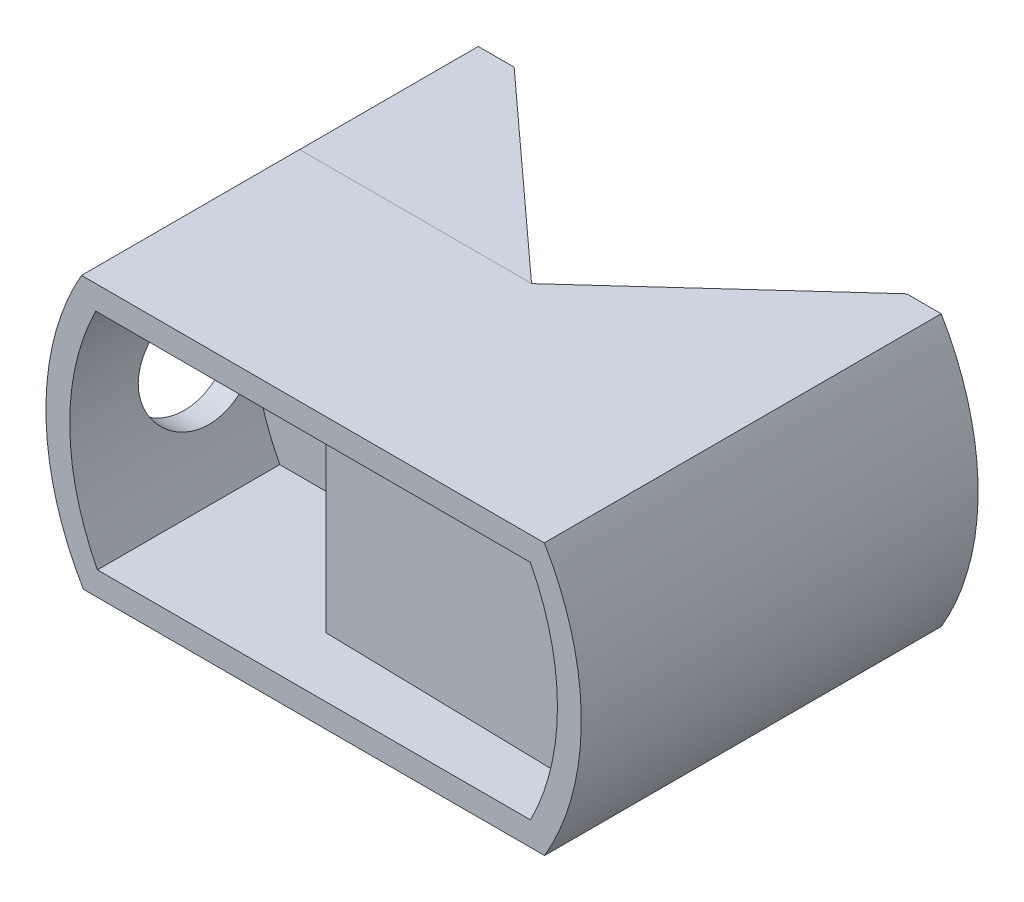
ISO-10303-21;
HEADER;
FILE_DESCRIPTION(('STEP AP214'),'2;1');
FILE_NAME('part.step','',(''),(''),'','','');
FILE_SCHEMA(('AUTOMOTIVE_DESIGN { 1 0 10303 214 1 1 1 1 }'));
ENDSEC;
DATA;
#1=APPLICATION_CONTEXT('core data for automotive mechanical design processes');
#2=APPLICATION_PROTOCOL_DEFINITION('international standard','automotive_design',2000,#1);
#3=PRODUCT_CONTEXT('',#1,'mechanical');
#4=PRODUCT('Part','Part','',(#3));
#5=PRODUCT_RELATED_PRODUCT_CATEGORY('part','',(#4));
#6=PRODUCT_DEFINITION_FORMATION('','',#4);
#7=PRODUCT_DEFINITION_CONTEXT('part definition',#1,'design');
#8=PRODUCT_DEFINITION('design','',#6,#7);
#9=PRODUCT_DEFINITION_SHAPE('','',#8);
#10=(LENGTH_UNIT() NAMED_UNIT(*) SI_UNIT(.MILLI.,.METRE.));
#11=(NAMED_UNIT(*) PLANE_ANGLE_UNIT() SI_UNIT($,.RADIAN.));
#12=(NAMED_UNIT(*) SI_UNIT($,.STERADIAN.) SOLID_ANGLE_UNIT());
#13=UNCERTAINTY_MEASURE_WITH_UNIT(LENGTH_MEASURE(1.E-05),#10,'distance_accuracy_value','');
#14=(GEOMETRIC_REPRESENTATION_CONTEXT(3) GLOBAL_UNCERTAINTY_ASSIGNED_CONTEXT((#13)) GLOBAL_UNIT_ASSIGNED_CONTEXT((#10,
#11,#12)) REPRESENTATION_CONTEXT('',''));
#15=CARTESIAN_POINT('',(0.,0.,0.));
#16=DIRECTION('',(0.,0.,1.));
#17=DIRECTION('',(1.,0.,0.));
#18=AXIS2_PLACEMENT_3D('',#15,#16,#17);
#19=CARTESIAN_POINT('',(19.3809793026079,-11.3404974553672,71.6356531865383));
#20=DIRECTION('',(-1.68538710840513E-05,-0.999999999857974,0.));
#21=DIRECTION('',(0.999999999857974,-1.68538710840513E-05,0.));
#22=AXIS2_PLACEMENT_3D('',#19,#20,#21);
#23=PLANE('',#22);
#24=DIRECTION('',(0.,0.,-1.));
#25=VECTOR('',#24,1.);
#26=CARTESIAN_POINT('',(-19.3097210142193,-11.3398453672918,71.6356531865383));
#27=LINE('',#26,#25);
#28=CARTESIAN_POINT('',(-19.3097210142193,-11.3398453672918,18.295));
#29=VERTEX_POINT('',#28);
#30=CARTESIAN_POINT('',(-19.3097210142193,-11.3398453672918,-15.));
#31=VERTEX_POINT('',#30);
#32=EDGE_CURVE('E269',#29,#31,#27,.T.);
#33=ORIENTED_EDGE('',*,*,#32,.T.);
#34=DIRECTION('',(0.999999999857974,-1.68538710840513E-05,0.));
#35=VECTOR('',#34,1.);
#36=CARTESIAN_POINT('',(-16.4436078184449,-11.3398936723941,-15.));
#37=LINE('',#36,#35);
#38=CARTESIAN_POINT('',(-16.4566439917599,-11.3398934526842,-15.));
#39=VERTEX_POINT('',#38);
#40=EDGE_CURVE('E306',#31,#39,#37,.T.);
#41=ORIENTED_EDGE('',*,*,#40,.T.);
#42=DIRECTION('',(0.739166009766756,-1.24578086400909E-05,0.673523280852484));
#43=VECTOR('',#42,1.);
#44=CARTESIAN_POINT('',(0.01240205117789,-11.3401710198631,0.00648809169434376));
#45=LINE('',#44,#43);
#46=CARTESIAN_POINT('',(-0.000191125776816126,-11.3401708076193,-0.00498672958642102));
#47=VERTEX_POINT('',#46);
#48=EDGE_CURVE('E352',#39,#47,#45,.T.);
#49=ORIENTED_EDGE('',*,*,#48,.T.);
#50=DIRECTION('',(-0.739166009766757,1.24578086400909E-05,0.673523280852484));
#51=VECTOR('',#50,1.);
#52=CARTESIAN_POINT('',(-0.0127843027315222,-11.3401705953755,0.00648809169434376));
#53=LINE('',#52,#51);
#54=CARTESIAN_POINT('',(16.4562617402063,-11.3404481625545,-15.));
#55=VERTEX_POINT('',#54);
#56=EDGE_CURVE('E196',#55,#47,#53,.T.);
#57=ORIENTED_EDGE('',*,*,#56,.F.);
#58=DIRECTION('',(-0.999999999857974,1.68538710840513E-05,0.));
#59=VECTOR('',#58,1.);
#60=CARTESIAN_POINT('',(16.4432255668913,-11.3404479428445,-15.));
#61=LINE('',#60,#59);
#62=CARTESIAN_POINT('',(19.3809793026079,-11.3404974553672,-15.));
#63=VERTEX_POINT('',#62);
#64=EDGE_CURVE('E194',#63,#55,#61,.T.);
#65=ORIENTED_EDGE('',*,*,#64,.F.);
#66=DIRECTION('',(0.,0.,-1.));
#67=VECTOR('',#66,1.);
#68=CARTESIAN_POINT('',(19.3809793026079,-11.3404974553672,71.6356531865383));
#69=LINE('',#68,#67);
#70=CARTESIAN_POINT('',(19.3809793026079,-11.3404974553672,18.295));
#71=VERTEX_POINT('',#70);
#72=EDGE_CURVE('E179',#71,#63,#69,.T.);
#73=ORIENTED_EDGE('',*,*,#72,.F.);
#74=DIRECTION('',(-0.999999999857974,1.68538710840513E-05,0.));
#75=VECTOR('',#74,1.);
#76=CARTESIAN_POINT('',(19.3809793026079,-11.3404974553672,18.295));
#77=LINE('',#76,#75);
#78=EDGE_CURVE('E263',#71,#29,#77,.T.);
#79=ORIENTED_EDGE('',*,*,#78,.T.);
#80=EDGE_LOOP('',(#33,#41,#49,#57,#65,#73,#79));
#81=FACE_BOUND('',#80,.T.);
#82=ADVANCED_FACE('F41',(#81),#23,.T.);
#83=CARTESIAN_POINT('',(-16.4440630833731,-38.3523779718514,-15.));
#84=DIRECTION('',(0.,0.,1.));
#85=DIRECTION('',(1.,0.,0.));
#86=AXIS2_PLACEMENT_3D('',#83,#84,#85);
#87=PLANE('',#86);
#88=CARTESIAN_POINT('',(0.141841088235117,0.159527249768601,-15.));
#89=DIRECTION('',(0.,0.,-1.));
#90=DIRECTION('',(0.,1.,0.));
#91=AXIS2_PLACEMENT_3D('',#88,#89,#90);
#92=CIRCLE('',#91,22.5964342056803);
#93=CARTESIAN_POINT('',(-19.476797576004,11.3714787201266,-15.));
#94=VERTEX_POINT('',#93);
#95=EDGE_CURVE('E182',#94,#31,#92,.F.);
#96=ORIENTED_EDGE('',*,*,#95,.F.);
#97=DIRECTION('',(0.999999891541181,0.000465744164088576,0.));
#98=VECTOR('',#97,1.);
#99=CARTESIAN_POINT('',(-16.4672223347851,11.3728804123836,-15.));
#100=LINE('',#99,#98);
#101=CARTESIAN_POINT('',(-16.4672223347851,11.3728804123836,-15.));
#102=VERTEX_POINT('',#101);
#103=EDGE_CURVE('E294',#94,#102,#100,.T.);
#104=ORIENTED_EDGE('',*,*,#103,.T.);
#105=DIRECTION('',(-0.000465744164088011,0.999999891541181,0.));
#106=VECTOR('',#105,1.);
#107=CARTESIAN_POINT('',(-16.4440630833731,-38.3523779718514,-15.));
#108=LINE('',#107,#106);
#109=EDGE_CURVE('E301',#39,#102,#108,.T.);
#110=ORIENTED_EDGE('',*,*,#109,.F.);
#111=ORIENTED_EDGE('',*,*,#40,.F.);
#112=EDGE_LOOP('',(#96,#104,#110,#111));
#113=FACE_BOUND('',#112,.T.);
#114=ADVANCED_FACE('F328',(#113),#87,.F.);
#115=CARTESIAN_POINT('',(150.032839062546,11.4504268527103,15.2950000000001));
#116=DIRECTION('',(-0.000465744164087947,0.999999891541181,0.));
#117=DIRECTION('',(0.999999891541181,0.000465744164087947,0.));
#118=AXIS2_PLACEMENT_3D('',#115,#116,#117);
#119=PLANE('',#118);
#120=ORIENTED_EDGE('',*,*,#103,.F.);
#121=DIRECTION('',(0.,0.,1.));
#122=VECTOR('',#121,1.);
#123=CARTESIAN_POINT('',(-19.476797576004,11.3714787201266,-65.8605845555164));
#124=LINE('',#123,#122);
#125=CARTESIAN_POINT('',(-19.476797576004,11.3714787201266,0.));
#126=VERTEX_POINT('',#125);
#127=EDGE_CURVE('E12',#94,#126,#124,.T.);
#128=ORIENTED_EDGE('',*,*,#127,.T.);
#129=DIRECTION('',(-0.999999891541181,-0.000465744164087947,0.));
#130=VECTOR('',#129,1.);
#131=CARTESIAN_POINT('',(-22.4672216840322,11.3700859473991,0.));
#132=LINE('',#131,#130);
#133=CARTESIAN_POINT('',(-0.00530042660601415,11.3805527583559,0.));
#134=VERTEX_POINT('',#133);
#135=EDGE_CURVE('E291',#134,#126,#132,.T.);
#136=ORIENTED_EDGE('',*,*,#135,.F.);
#137=DIRECTION('',(0.739165890655606,0.000344262237203824,0.673523323705139));
#138=VECTOR('',#137,1.);
#139=CARTESIAN_POINT('',(-0.00530042413707243,11.3805474572747,0.));
#140=LINE('',#139,#138);
#141=EDGE_CURVE('E292',#102,#134,#140,.T.);
#142=ORIENTED_EDGE('',*,*,#141,.F.);
#143=EDGE_LOOP('',(#120,#128,#136,#142));
#144=FACE_BOUND('',#143,.T.);
#145=ADVANCED_FACE('F348',(#144),#119,.T.);
#146=CARTESIAN_POINT('',(0.0518471338651627,-0.000472285841379705,0.));
#147=DIRECTION('',(0.,0.,-1.));
#148=DIRECTION('',(-1.,0.,0.));
#149=AXIS2_PLACEMENT_3D('',#146,#147,#148);
#150=PLANE('',#149);
#151=DIRECTION('',(0.000499451902330832,0.999999875273891,0.));
#152=VECTOR('',#151,1.);
#153=CARTESIAN_POINT('',(-0.0191513408939192,-38.3447103031956,0.));
#154=LINE('',#153,#152);
#155=CARTESIAN_POINT('',(0.,1.58831281460436E-10,0.));
#156=VERTEX_POINT('',#155);
#157=CARTESIAN_POINT('',(0.0056840366935984,11.380547272144,0.));
#158=VERTEX_POINT('',#157);
#159=EDGE_CURVE('E197',#156,#158,#154,.T.);
#160=ORIENTED_EDGE('',*,*,#159,.F.);
#161=DIRECTION('',(-0.000465744164088011,0.999999891541181,0.));
#162=VECTOR('',#161,1.);
#163=CARTESIAN_POINT('',(0.0178588272749802,-38.3447109269603,0.));
#164=LINE('',#163,#162);
#165=EDGE_CURVE('E57',#156,#134,#164,.T.);
#166=ORIENTED_EDGE('',*,*,#165,.T.);
#167=DIRECTION('',(0.999999875273891,-0.000499451902330832,0.));
#168=VECTOR('',#167,1.);
#169=CARTESIAN_POINT('',(-19.466045098466,11.3902724655153,0.));
#170=LINE('',#169,#168);
#171=EDGE_CURVE('E235',#134,#158,#170,.T.);
#172=ORIENTED_EDGE('',*,*,#171,.T.);
#173=EDGE_LOOP('',(#160,#166,#172));
#174=FACE_BOUND('',#173,.T.);
#175=ADVANCED_FACE('F290',(#174),#150,.T.);
#176=CARTESIAN_POINT('',(-19.466045098466,11.3902724655153,0.));
#177=VERTEX_POINT('',#176);
#178=EDGE_CURVE('E231',#177,#134,#170,.T.);
#179=ORIENTED_EDGE('',*,*,#178,.T.);
#180=ORIENTED_EDGE('',*,*,#135,.T.);
#181=CARTESIAN_POINT('',(0.141841088235145,0.159527249768601,0.));
#182=DIRECTION('',(0.,0.,-1.));
#183=DIRECTION('',(-1.,0.,0.));
#184=AXIS2_PLACEMENT_3D('',#181,#182,#183);
#185=CIRCLE('',#184,22.5964342056804);
#186=EDGE_CURVE('E216',#126,#177,#185,.T.);
#187=ORIENTED_EDGE('',*,*,#186,.T.);
#188=EDGE_LOOP('',(#179,#180,#187));
#189=FACE_BOUND('',#188,.T.);
#190=ADVANCED_FACE('F360',(#189),#150,.T.);
#191=CARTESIAN_POINT('',(-0.0191513408939192,-38.3447103031956,0.));
#192=DIRECTION('',(-0.673523239699195,0.000336392505288716,-0.739165970824674));
#193=DIRECTION('',(-0.739166012646658,0.,0.673523277807115));
#194=AXIS2_PLACEMENT_3D('',#191,#192,#193);
#195=PLANE('',#194);
#196=ORIENTED_EDGE('',*,*,#56,.T.);
#197=DIRECTION('',(1.68538694545223E-05,0.999999903172242,0.00043974021098058));
#198=VECTOR('',#197,1.);
#199=CARTESIAN_POINT('',(-0.000646256684500024,-38.3447032003055,-0.0168617095080408));
#200=LINE('',#199,#198);
#201=EDGE_CURVE('E47',#47,#156,#200,.T.);
#202=ORIENTED_EDGE('',*,*,#201,.T.);
#203=ORIENTED_EDGE('',*,*,#159,.T.);
#204=DIRECTION('',(-0.739165878631379,0.000369177850266383,0.673523323705139));
#205=VECTOR('',#204,1.);
#206=CARTESIAN_POINT('',(0.0056840366935984,11.380547272144,0.));
#207=LINE('',#206,#205);
#208=CARTESIAN_POINT('',(16.4676056795507,11.372325333038,-15.));
#209=VERTEX_POINT('',#208);
#210=EDGE_CURVE('E186',#209,#158,#207,.T.);
#211=ORIENTED_EDGE('',*,*,#210,.F.);
#212=DIRECTION('',(0.000499451902330832,0.999999875273891,0.));
#213=VECTOR('',#212,1.);
#214=CARTESIAN_POINT('',(16.4427703019632,-38.3529322423017,-15.));
#215=LINE('',#214,#213);
#216=EDGE_CURVE('E190',#55,#209,#215,.T.);
#217=ORIENTED_EDGE('',*,*,#216,.F.);
#218=EDGE_LOOP('',(#196,#202,#203,#211,#217));
#219=FACE_BOUND('',#218,.T.);
#220=ADVANCED_FACE('F285',(#219),#195,.T.);
#221=CARTESIAN_POINT('',(0.0518471338651627,-0.000472285841379705,3.));
#222=DIRECTION('',(0.,0.,-1.));
#223=DIRECTION('',(-1.,0.,0.));
#224=AXIS2_PLACEMENT_3D('',#221,#222,#223);
#225=PLANE('',#224);
#226=DIRECTION('',(-1.,0.,0.));
#227=VECTOR('',#226,1.);
#228=CARTESIAN_POINT('',(11.3610878099327,-2.86253145370721,3.));
#229=LINE('',#228,#227);
#230=CARTESIAN_POINT('',(-20.2316775863008,-2.8625314537072,3.));
#231=VERTEX_POINT('',#230);
#232=CARTESIAN_POINT('',(-3.48815459498486,-2.86253145370716,2.99999999999996));
#233=VERTEX_POINT('',#232);
#234=EDGE_CURVE('E191',#231,#233,#229,.F.);
#235=ORIENTED_EDGE('',*,*,#234,.F.);
#236=CARTESIAN_POINT('',(0.141841088235117,0.159527249768601,3.));
#237=DIRECTION('',(0.,0.,1.));
#238=DIRECTION('',(1.,0.,0.));
#239=AXIS2_PLACEMENT_3D('',#236,#237,#238);
#240=CIRCLE('',#239,20.5964342056803);
#241=CARTESIAN_POINT('',(-18.1331321027047,-9.3398651970856,3.));
#242=VERTEX_POINT('',#241);
#243=EDGE_CURVE('E237',#231,#242,#240,.T.);
#244=ORIENTED_EDGE('',*,*,#243,.T.);
#245=DIRECTION('',(0.999999999857974,-1.68538710840339E-05,0.));
#246=VECTOR('',#245,1.);
#247=CARTESIAN_POINT('',(-18.1331321027047,-9.3398651970856,3.));
#248=LINE('',#247,#246);
#249=CARTESIAN_POINT('',(18.1994507698969,-9.34047754175357,3.));
#250=VERTEX_POINT('',#249);
#251=EDGE_CURVE('E242',#242,#250,#248,.T.);
#252=ORIENTED_EDGE('',*,*,#251,.T.);
#253=DIRECTION('',(0.999733959219368,-0.0230653589516354,0.));
#254=VECTOR('',#253,1.);
#255=CARTESIAN_POINT('',(18.1994507698969,-9.34047754175357,2.99999999999997));
#256=LINE('',#255,#254);
#257=CARTESIAN_POINT('',(-3.48815459498486,-8.84011202157757,2.99999999999997));
#258=VERTEX_POINT('',#257);
#259=EDGE_CURVE('E207',#258,#250,#256,.T.);
#260=ORIENTED_EDGE('',*,*,#259,.F.);
#261=DIRECTION('',(0.,-1.,0.));
#262=VECTOR('',#261,1.);
#263=CARTESIAN_POINT('',(-3.48815459498486,9.3822920272605,2.99999999999997));
#264=LINE('',#263,#262);
#265=EDGE_CURVE('E215',#233,#258,#264,.T.);
#266=ORIENTED_EDGE('',*,*,#265,.F.);
#267=EDGE_LOOP('',(#235,#244,#252,#260,#266));
#268=FACE_BOUND('',#267,.T.);
#269=ADVANCED_FACE('F398',(#268),#225,.F.);
#270=DIRECTION('',(-1.,0.,0.));
#271=VECTOR('',#270,1.);
#272=CARTESIAN_POINT('',(11.3610878099327,3.16158673902442,3.));
#273=LINE('',#272,#271);
#274=CARTESIAN_POINT('',(-3.48815459498486,3.16158673902436,2.99999999999996));
#275=VERTEX_POINT('',#274);
#276=CARTESIAN_POINT('',(-20.2346340930098,3.16158673902441,3.));
#277=VERTEX_POINT('',#276);
#278=EDGE_CURVE('E313',#275,#277,#273,.T.);
#279=ORIENTED_EDGE('',*,*,#278,.F.);
#280=CARTESIAN_POINT('',(-3.48815459498486,9.38229202726051,2.99999999999998));
#281=VERTEX_POINT('',#280);
#282=EDGE_CURVE('E213',#281,#275,#264,.T.);
#283=ORIENTED_EDGE('',*,*,#282,.F.);
#284=DIRECTION('',(-0.999999875273891,0.000499451902330926,0.));
#285=VECTOR('',#284,1.);
#286=CARTESIAN_POINT('',(18.182979058631,9.37146833698155,3.));
#287=LINE('',#286,#285);
#288=CARTESIAN_POINT('',(-18.2705860163711,9.38967514167585,3.));
#289=VERTEX_POINT('',#288);
#290=EDGE_CURVE('E240',#281,#289,#287,.T.);
#291=ORIENTED_EDGE('',*,*,#290,.T.);
#292=EDGE_CURVE('E241',#289,#277,#240,.T.);
#293=ORIENTED_EDGE('',*,*,#292,.T.);
#294=EDGE_LOOP('',(#279,#283,#291,#293));
#295=FACE_BOUND('',#294,.T.);
#296=ADVANCED_FACE('F336',(#295),#225,.F.);
#297=CARTESIAN_POINT('',(0.141841088235117,0.159527249768601,71.6356531865383));
#298=DIRECTION('',(0.,0.,-1.));
#299=DIRECTION('',(-1.,0.,0.));
#300=AXIS2_PLACEMENT_3D('',#297,#298,#299);
#301=CYLINDRICAL_SURFACE('',#300,22.5964342056804);
#302=ORIENTED_EDGE('',*,*,#32,.F.);
#303=CARTESIAN_POINT('',(0.141841088235117,0.159527249768601,18.295));
#304=DIRECTION('',(0.,0.,1.));
#305=DIRECTION('',(1.,0.,0.));
#306=AXIS2_PLACEMENT_3D('',#303,#304,#305);
#307=CIRCLE('',#306,22.5964342056804);
#308=CARTESIAN_POINT('',(-19.466045098466,11.3902724655153,18.295));
#309=VERTEX_POINT('',#308);
#310=EDGE_CURVE('E274',#29,#309,#307,.F.);
#311=ORIENTED_EDGE('',*,*,#310,.T.);
#312=DIRECTION('',(0.,0.,-1.));
#313=VECTOR('',#312,1.);
#314=CARTESIAN_POINT('',(-19.466045098466,11.3902724655153,71.6356531865383));
#315=LINE('',#314,#313);
#316=EDGE_CURVE('E271',#309,#177,#315,.T.);
#317=ORIENTED_EDGE('',*,*,#316,.T.);
#318=ORIENTED_EDGE('',*,*,#186,.F.);
#319=ORIENTED_EDGE('',*,*,#127,.F.);
#320=ORIENTED_EDGE('',*,*,#95,.T.);
#321=EDGE_LOOP('',(#302,#311,#317,#318,#319,#320));
#322=FACE_BOUND('',#321,.T.);
#323=CARTESIAN_POINT('',(-22.4545909048805,0.149527642658603,12.55));
#324=CARTESIAN_POINT('',(-22.4545287054822,0.00411694934017982,12.550003753029));
#325=CARTESIAN_POINT('',(-22.4530564038504,-0.141249928952372,12.5439576189278));
#326=CARTESIAN_POINT('',(-22.4473402742222,-0.430971793468841,12.5198311963753));
#327=CARTESIAN_POINT('',(-22.4430960149461,-0.57532661869774,12.5017490352705));
#328=CARTESIAN_POINT('',(-22.4319477582586,-0.861986120825077,12.4536855809295));
#329=CARTESIAN_POINT('',(-22.4250427543545,-1.0042900007448,12.4236997847177));
#330=CARTESIAN_POINT('',(-22.4087606399012,-1.28584139262337,12.3520612356978));
#331=CARTESIAN_POINT('',(-22.3993826189983,-1.42508775857656,12.3104041861767));
#332=CARTESIAN_POINT('',(-22.3784277403922,-1.69929290466323,12.2158280471653));
#333=CARTESIAN_POINT('',(-22.3668542114703,-1.83425781924745,12.1629259926588));
#334=CARTESIAN_POINT('',(-22.3418076558655,-2.09925545782735,12.0462031753627));
#335=CARTESIAN_POINT('',(-22.3283339285424,-2.2292863400051,11.9823783832861));
#336=CARTESIAN_POINT('',(-22.2998576111086,-2.48345352805002,11.8443170892911));
#337=CARTESIAN_POINT('',(-22.2848556249261,-2.60759213418068,11.7700846958564));
#338=CARTESIAN_POINT('',(-22.2537125818374,-2.84927111448183,11.611680606953));
#339=CARTESIAN_POINT('',(-22.2375710987716,-2.96680899022643,11.5275051848894));
#340=CARTESIAN_POINT('',(-22.2043223030988,-3.1962849039629,11.3484016034868));
#341=CARTESIAN_POINT('',(-22.187203762537,-3.30810517532129,11.2533246104718));
#342=CARTESIAN_POINT('',(-22.1527023915918,-3.52341510990701,11.0541323006186));
#343=CARTESIAN_POINT('',(-22.1353194655402,-3.62690166799732,10.9500136446183));
#344=CARTESIAN_POINT('',(-22.1007795022009,-3.82478653482277,10.7334865765645));
#345=CARTESIAN_POINT('',(-22.0836224057397,-3.91918726692989,10.6210803891664));
#346=CARTESIAN_POINT('',(-22.0500005884918,-4.09832566999032,10.3886538495476));
#347=CARTESIAN_POINT('',(-22.033536125513,-4.18305976262389,10.2686307031629));
#348=CARTESIAN_POINT('',(-22.001576067869,-4.34321343433845,10.020269021767));
#349=CARTESIAN_POINT('',(-21.9860948187803,-4.4185061434151,9.89184660977742));
#350=CARTESIAN_POINT('',(-21.9567747445646,-4.55800154763713,9.62891872732907));
#351=CARTESIAN_POINT('',(-21.9429365393526,-4.62220006111497,9.49441098716368));
#352=CARTESIAN_POINT('',(-21.9045489074905,-4.79728477430381,9.08326351194153));
#353=CARTESIAN_POINT('',(-21.8830846337487,-4.8908616314836,8.79868685634578));
#354=CARTESIAN_POINT('',(-21.8513901588437,-5.0271348344927,8.22244437978871));
#355=CARTESIAN_POINT('',(-21.8409693979424,-5.07069536958436,7.93099064488189));
#356=CARTESIAN_POINT('',(-21.8319451846787,-5.10848601109281,7.34469892420038));
#357=CARTESIAN_POINT('',(-21.8333400799061,-5.10272301536545,7.04986141740271));
#358=CARTESIAN_POINT('',(-21.84762479151,-5.04269418144626,6.47169992719215));
#359=CARTESIAN_POINT('',(-21.8602751412584,-4.98943872015221,6.1882640060651));
#360=CARTESIAN_POINT('',(-21.8952659586319,-4.83754879770656,5.63446086361934));
#361=CARTESIAN_POINT('',(-21.9176070331422,-4.73891149447674,5.36409446196295));
#362=CARTESIAN_POINT('',(-21.9696953418713,-4.49815658623132,4.84132274856027));
#363=CARTESIAN_POINT('',(-21.9995067488157,-4.35565965562843,4.5890987957338));
#364=CARTESIAN_POINT('',(-22.0631438272727,-4.03149780274392,4.11177345693344));
#365=CARTESIAN_POINT('',(-22.096970113319,-3.84982688084806,3.8866762337406));
#366=CARTESIAN_POINT('',(-22.1658527839786,-3.44717146692472,3.46418459272148));
#367=CARTESIAN_POINT('',(-22.2009189623236,-3.22533005464994,3.26760756002192));
#368=CARTESIAN_POINT('',(-22.2675848748599,-2.75142375455699,2.91430357081525));
#369=CARTESIAN_POINT('',(-22.299184527662,-2.49935815740725,2.75757754984127));
#370=CARTESIAN_POINT('',(-22.355493095807,-1.97107309460097,2.48817214833866));
#371=CARTESIAN_POINT('',(-22.380183088595,-1.69478996963982,2.37561339065743));
#372=CARTESIAN_POINT('',(-22.4197617940561,-1.12652596925225,2.19875528585833));
#373=CARTESIAN_POINT('',(-22.4346521202343,-0.834547686585168,2.13444799394114));
#374=CARTESIAN_POINT('',(-22.4527277449666,-0.250161512444054,2.05713043494811));
#375=CARTESIAN_POINT('',(-22.4561666278325,0.042091641069117,2.04300836831294));
#376=CARTESIAN_POINT('',(-22.4516810854654,0.624786766663514,2.0634361735708));
#377=CARTESIAN_POINT('',(-22.4437575413712,0.915228877434138,2.09798227131862));
#378=CARTESIAN_POINT('',(-22.4176089218754,1.48227450687956,2.21384352008034));
#379=CARTESIAN_POINT('',(-22.3995152941577,1.75900652321799,2.29456212518831));
#380=CARTESIAN_POINT('',(-22.3550695009964,2.29499957773866,2.49980967586455));
#381=CARTESIAN_POINT('',(-22.3287165766166,2.55425900772594,2.6243426476085));
#382=CARTESIAN_POINT('',(-22.2700712444305,3.05244710486585,2.9159187766601));
#383=CARTESIAN_POINT('',(-22.2376920773083,3.29099264545411,3.08359868670004));
#384=CARTESIAN_POINT('',(-22.1707511240196,3.73695777709895,3.45588208446256));
#385=CARTESIAN_POINT('',(-22.1361890163376,3.9443727678142,3.66049101958015));
#386=CARTESIAN_POINT('',(-22.0678960908636,4.32665865569461,4.10594233617131));
#387=CARTESIAN_POINT('',(-22.0341978918171,4.50075610730946,4.34745441531505));
#388=CARTESIAN_POINT('',(-21.9722743263825,4.80593317537586,4.85694276640027));
#389=CARTESIAN_POINT('',(-21.944048718792,4.93701468791367,5.12491787120868));
#390=CARTESIAN_POINT('',(-21.8965552401208,5.15151922358171,5.67822675249015));
#391=CARTESIAN_POINT('',(-21.8772359242423,5.23521660565437,5.96344979097608));
#392=CARTESIAN_POINT('',(-21.849680693135,5.35333393806664,6.5445924202584));
#393=CARTESIAN_POINT('',(-21.8414427470888,5.38776291760966,6.8405100409115));
#394=CARTESIAN_POINT('',(-21.8381595015944,5.40150149606528,7.28164774388593));
#395=CARTESIAN_POINT('',(-21.8385201845275,5.40000231873077,7.42648678825442));
#396=CARTESIAN_POINT('',(-21.8420800199687,5.38505571358689,7.71549699554586));
#397=CARTESIAN_POINT('',(-21.84527808143,5.37161287842556,7.85966839377814));
#398=CARTESIAN_POINT('',(-21.8544237984487,5.33287768276063,8.14636031542068));
#399=CARTESIAN_POINT('',(-21.8603723926589,5.30758127704204,8.28888025821852));
#400=CARTESIAN_POINT('',(-21.8748384022087,5.24535893746134,8.57117369341411));
#401=CARTESIAN_POINT('',(-21.883354908451,5.2084371190468,8.71094813915601));
#402=CARTESIAN_POINT('',(-21.902668786362,5.12342816079525,8.98626414738493));
#403=CARTESIAN_POINT('',(-21.9134566714574,5.0753873797328,9.12182070439771));
#404=CARTESIAN_POINT('',(-21.9370214453456,4.96844220501679,9.38834218933933));
#405=CARTESIAN_POINT('',(-21.9497976389185,4.90954160721593,9.51930870265824));
#406=CARTESIAN_POINT('',(-21.9769895234682,4.78126599245471,9.77590039495798));
#407=CARTESIAN_POINT('',(-21.9914059310579,4.71188639282731,9.90152320607876));
#408=CARTESIAN_POINT('',(-22.0214712760172,4.56318184219147,10.1465215375465));
#409=CARTESIAN_POINT('',(-22.0371198012954,4.48386021116448,10.2658991246109));
#410=CARTESIAN_POINT('',(-22.0695995061075,4.31385073241585,10.5003690184447));
#411=CARTESIAN_POINT('',(-22.0864496063478,4.22294346072624,10.6152996609974));
#412=CARTESIAN_POINT('',(-22.1205240794259,4.03190943582363,10.837092940947));
#413=CARTESIAN_POINT('',(-22.1377483213777,3.93178586829051,10.9439583430813));
#414=CARTESIAN_POINT('',(-22.1721110754271,3.72289438509509,11.1490237959643));
#415=CARTESIAN_POINT('',(-22.1892495309567,3.61412140480139,11.2472186976579));
#416=CARTESIAN_POINT('',(-22.222952863425,3.38873872324496,11.4341797353594));
#417=CARTESIAN_POINT('',(-22.2395179479256,3.27213190377734,11.5229493079414));
#418=CARTESIAN_POINT('',(-22.2718734952594,3.02996011784951,11.6917796467662));
#419=CARTESIAN_POINT('',(-22.287648135211,2.90428499617623,11.7716855553806));
#420=CARTESIAN_POINT('',(-22.3176906790228,2.64651392997972,11.9205742700192));
#421=CARTESIAN_POINT('',(-22.3319591353136,2.51442036572225,11.9895610855637));
#422=CARTESIAN_POINT('',(-22.3585818169133,2.2447477964807,12.1160895044105));
#423=CARTESIAN_POINT('',(-22.370936997478,2.10717157228835,12.1736368232948));
#424=CARTESIAN_POINT('',(-22.3933845413103,1.82750410605946,12.2768588166874));
#425=CARTESIAN_POINT('',(-22.4034772824358,1.68541362249757,12.3225354739593));
#426=CARTESIAN_POINT('',(-22.4261425077072,1.31543531039745,12.4242637369254));
#427=CARTESIAN_POINT('',(-22.4368388298959,1.08489676147967,12.4713402871657));
#428=CARTESIAN_POINT('',(-22.4511130624822,0.619376421263428,12.5342045165315));
#429=CARTESIAN_POINT('',(-22.4546913692988,0.384394878141592,12.5499939381106));
#430=CARTESIAN_POINT('',(-22.4545909048805,0.149527642658603,12.55));
#431=B_SPLINE_CURVE_WITH_KNOTS('',3,(#323,#324,#325,#326,#327,#328,#329,#330,#331,#332,#333,
#334,#335,#336,#337,#338,#339,#340,#341,#342,#343,#344,#345,#346,#347,#348,#349,#350,#351,#352,
#353,#354,#355,#356,#357,#358,#359,#360,#361,#362,#363,#364,#365,#366,#367,#368,#369,#370,#371,
#372,#373,#374,#375,#376,#377,#378,#379,#380,#381,#382,#383,#384,#385,#386,#387,#388,#389,#390,
#391,#392,#393,#394,#395,#396,#397,#398,#399,#400,#401,#402,#403,#404,#405,#406,#407,#408,#409,
#410,#411,#412,#413,#414,#415,#416,#417,#418,#419,#420,#421,#422,#423,#424,#425,#426,#427,#428,
#429,#430),.UNSPECIFIED.,.T.,.F.,(4,2,2,2,2,2,2,2,2,2,2,2,2,2,2,2,2,2,2,2,2,2,2,2,2,2,2,2,2,2,2,
2,2,2,2,2,2,2,2,2,2,2,2,2,2,2,2,2,2,2,2,2,2,4),(0.,0.436025408854694,0.872118673609292,
1.30837706367687,1.74479627158247,2.1805590035661,2.616482831864,3.05223505775639,
3.48815112260798,3.93095218254788,4.37391747380634,4.8167642880135,5.25977450343436,
5.70821360871912,6.15682137448817,7.05292854550188,7.93330794001948,8.8135642162039,
9.67552877922419,10.5375473308913,11.4072412351162,12.2770684302937,13.1682861126783,
14.0595247151515,14.9531806673288,15.846689443124,16.7202756433042,17.5937941018767,
18.4562737503144,19.318832674163,20.1949346435276,21.0711659523427,21.9657673074319,
22.8603292243665,23.7496571256262,24.6388220227916,25.0729380232979,25.5068871670871,
25.9409845107325,26.3749283544443,26.8070945305968,27.2391099362571,27.6713148204546,
28.1033757594027,28.5453719797174,28.9872159904467,29.429320653853,29.871263563669,
30.320000396647,30.7685720680482,31.2169190505304,31.6651910971563,32.3694982142254,
33.0737661056781),.UNSPECIFIED.);
#432=CARTESIAN_POINT('',(-22.4545909048805,0.149527642658603,12.55));
#433=VERTEX_POINT('',#432);
#434=EDGE_CURVE('E188',#433,#433,#431,.T.);
#435=ORIENTED_EDGE('',*,*,#434,.T.);
#436=EDGE_LOOP('',(#435));
#437=FACE_BOUND('',#436,.T.);
#438=ADVANCED_FACE('F332',(#322,#437),#301,.T.);
#439=CARTESIAN_POINT('',(0.141841088235117,0.159527249768601,3.));
#440=DIRECTION('',(0.,0.,1.));
#441=DIRECTION('',(1.,0.,0.));
#442=AXIS2_PLACEMENT_3D('',#439,#440,#441);
#443=CYLINDRICAL_SURFACE('',#442,20.5964342056803);
#444=CARTESIAN_POINT('',(-20.2346340930098,3.16158673902441,3.));
#445=CARTESIAN_POINT('',(-20.2167348537502,3.28311030700675,3.08510996498643));
#446=CARTESIAN_POINT('',(-20.1982579848356,3.40095014772827,3.17534682049361));
#447=CARTESIAN_POINT('',(-20.1606821743144,3.62851847125637,3.36540157896373));
#448=CARTESIAN_POINT('',(-20.1415832583453,3.73824728774903,3.46521908739154));
#449=CARTESIAN_POINT('',(-20.1032890817965,3.94889222497803,3.67380165673548));
#450=CARTESIAN_POINT('',(-20.0840937933504,4.04980562056941,3.78256946445432));
#451=CARTESIAN_POINT('',(-20.0461571573237,4.24210389788485,4.00829834356529));
#452=CARTESIAN_POINT('',(-20.0274158064299,4.33348884917319,4.12525935513089));
#453=CARTESIAN_POINT('',(-19.9909156732392,4.50613506920893,4.36665686771363));
#454=CARTESIAN_POINT('',(-19.9731573419016,4.58739171265521,4.49109674594157));
#455=CARTESIAN_POINT('',(-19.9391451082937,4.7391723124394,4.74661960288466));
#456=CARTESIAN_POINT('',(-19.9228917627218,4.80969230342538,4.87770501227323));
#457=CARTESIAN_POINT('',(-19.892395790469,4.93936933150321,5.14546420538695));
#458=CARTESIAN_POINT('',(-19.87815140943,4.998536299277,5.28213297713389));
#459=CARTESIAN_POINT('',(-19.8520864157727,5.10512928404577,5.56025915265604));
#460=CARTESIAN_POINT('',(-19.8402666717567,5.15255109471105,5.70171825144862));
#461=CARTESIAN_POINT('',(-19.8195726723544,5.23464607368192,5.98634120690773));
#462=CARTESIAN_POINT('',(-19.8106594427236,5.26948866451204,6.1294533537335));
#463=CARTESIAN_POINT('',(-19.7958274294141,5.3270568340279,6.41830511300886));
#464=CARTESIAN_POINT('',(-19.7899097548019,5.34977792504901,6.56404567794564));
#465=CARTESIAN_POINT('',(-19.7812616539485,5.38287603172123,6.85696375137884));
#466=CARTESIAN_POINT('',(-19.77853009405,5.39325743800299,7.00414072997532));
#467=CARTESIAN_POINT('',(-19.7763368122783,5.40159845995535,7.29892577249874));
#468=CARTESIAN_POINT('',(-19.776876279011,5.39955356022967,7.44653397364456));
#469=CARTESIAN_POINT('',(-19.7811492705225,5.38328293391993,7.73686013354648));
#470=CARTESIAN_POINT('',(-19.7847925254402,5.36940144973374,7.87959885912404));
#471=CARTESIAN_POINT('',(-19.795045963719,5.33002530228754,8.16340958063079));
#472=CARTESIAN_POINT('',(-19.8016572154589,5.30452645711988,8.30448095758662));
#473=CARTESIAN_POINT('',(-19.8176479439467,5.24213820464158,8.58385950471845));
#474=CARTESIAN_POINT('',(-19.8270262884165,5.20525345609101,8.72216778087102));
#475=CARTESIAN_POINT('',(-19.848282405745,5.12037171267435,8.99518628595387));
#476=CARTESIAN_POINT('',(-19.8601611173487,5.07237054354736,9.12989514204046));
#477=CARTESIAN_POINT('',(-19.88613971783,4.965370497074,9.39540741117482));
#478=CARTESIAN_POINT('',(-19.9002498768499,4.90632052582128,9.5261892645794));
#479=CARTESIAN_POINT('',(-19.9302506816656,4.77781547151189,9.78234129723512));
#480=CARTESIAN_POINT('',(-19.9461419758043,4.70835659643616,9.90770948272811));
#481=CARTESIAN_POINT('',(-19.9958325298933,4.48508644597666,10.2744198926358));
#482=CARTESIAN_POINT('',(-20.0316715642234,4.31629080768646,10.506592444612));
#483=CARTESIAN_POINT('',(-20.1060092198552,3.93786613430819,10.9466138312244));
#484=CARTESIAN_POINT('',(-20.1445552496928,3.72717137254267,11.1535331419569));
#485=CARTESIAN_POINT('',(-20.2190781607453,3.27380976052054,11.5294236144083));
#486=CARTESIAN_POINT('',(-20.2550548765669,3.03114085486064,11.698392334648));
#487=CARTESIAN_POINT('',(-20.3207666252349,2.5179586350606,11.9948492474461));
#488=CARTESIAN_POINT('',(-20.3504440144601,2.24721931981312,12.1219597740582));
#489=CARTESIAN_POINT('',(-20.3997727691499,1.687294231122,12.3285957034791));
#490=CARTESIAN_POINT('',(-20.4194259762516,1.39811185701805,12.4081298474588));
#491=CARTESIAN_POINT('',(-20.446098454258,0.817058550904789,12.5155592090134));
#492=CARTESIAN_POINT('',(-20.4534143416917,0.525425458160929,12.5446672662827));
#493=CARTESIAN_POINT('',(-20.4555070105209,-0.0586465771399487,12.5539930673406));
#494=CARTESIAN_POINT('',(-20.4502853213596,-0.351085417057931,12.534216774461));
#495=CARTESIAN_POINT('',(-20.4280994629267,-0.922555789608258,12.4473368837575));
#496=CARTESIAN_POINT('',(-20.4113638610701,-1.20173715140082,12.3811540392811));
#497=CARTESIAN_POINT('',(-20.3681656835667,-1.74494733497015,12.2045944723507));
#498=CARTESIAN_POINT('',(-20.3417023096808,-2.00897491120503,12.094214123082));
#499=CARTESIAN_POINT('',(-20.2813636437205,-2.51865819750966,11.8306502956108));
#500=CARTESIAN_POINT('',(-20.247387102087,-2.76399458292343,11.676873308749));
#501=CARTESIAN_POINT('',(-20.1758162340487,-3.22582402329314,11.3314597710104));
#502=CARTESIAN_POINT('',(-20.1382212489547,-3.44231180958052,11.139816320341));
#503=CARTESIAN_POINT('',(-20.0623369700575,-3.84644033388559,10.71795485651));
#504=CARTESIAN_POINT('',(-20.0240567290899,-4.03313255173947,10.4868268300006));
#505=CARTESIAN_POINT('',(-19.9521510700805,-4.36524761394283,9.99574204550203));
#506=CARTESIAN_POINT('',(-19.9185256638033,-4.51067035398955,9.73578521465451));
#507=CARTESIAN_POINT('',(-19.8745604863705,-4.69440811539702,9.33000676932706));
#508=CARTESIAN_POINT('',(-19.8609824611957,-4.74992793617542,9.19208153143612));
#509=CARTESIAN_POINT('',(-19.8363749027176,-4.84912651804703,8.9118339376924));
#510=CARTESIAN_POINT('',(-19.8253443477519,-4.89281002731245,8.76951337063855));
#511=CARTESIAN_POINT('',(-19.8061753797647,-4.96797166631002,8.48146995015633));
#512=CARTESIAN_POINT('',(-19.7980375855106,-4.99944718485913,8.33574637591319));
#513=CARTESIAN_POINT('',(-19.784916797545,-5.04989729468334,8.04206753859779));
#514=CARTESIAN_POINT('',(-19.779932495512,-5.06887707032775,7.89411322713298));
#515=CARTESIAN_POINT('',(-19.7733709253316,-5.09381383323533,7.60136723228635));
#516=CARTESIAN_POINT('',(-19.7716989787648,-5.10013277262962,7.45660837744715));
#517=CARTESIAN_POINT('',(-19.7715266895456,-5.10078513666855,7.16711748273095));
#518=CARTESIAN_POINT('',(-19.773025097208,-5.09512328388221,7.0223854547698));
#519=CARTESIAN_POINT('',(-19.7791459775365,-5.07187026639273,6.73391923751202));
#520=CARTESIAN_POINT('',(-19.7837691266696,-5.0542765185824,6.59018527109154));
#521=CARTESIAN_POINT('',(-19.7959974767312,-5.00731729183998,6.30483663004557));
#522=CARTESIAN_POINT('',(-19.8036016036691,-4.97795605243047,6.1632212112023));
#523=CARTESIAN_POINT('',(-19.8214591589598,-4.90811782615433,5.8846920508755));
#524=CARTESIAN_POINT('',(-19.831680707393,-4.86777425387197,5.74774276343549));
#525=CARTESIAN_POINT('',(-19.8545157863827,-4.77616311877779,5.47780957719393));
#526=CARTESIAN_POINT('',(-19.8671284773572,-4.72489938949096,5.34482430545033));
#527=CARTESIAN_POINT('',(-19.894405965272,-4.61177155671822,5.0835117566867));
#528=CARTESIAN_POINT('',(-19.9090726919789,-4.54989747238924,4.95518900456344));
#529=CARTESIAN_POINT('',(-19.9400394045293,-4.41604839436053,4.70418819524087));
#530=CARTESIAN_POINT('',(-19.9563388578963,-4.34407669072098,4.58150831666993));
#531=CARTESIAN_POINT('',(-19.9905696127899,-4.18853464760035,4.33943560499864));
#532=CARTESIAN_POINT('',(-20.0085320611165,-4.10471401903359,4.22020796317828));
#533=CARTESIAN_POINT('',(-20.0452111712872,-3.92754990093411,3.98924274096949));
#534=CARTESIAN_POINT('',(-20.0639275682982,-3.83420973789886,3.87750256663033));
#535=CARTESIAN_POINT('',(-20.1015783741906,-3.63875658493274,3.66235011466888));
#536=CARTESIAN_POINT('',(-20.12051239868,-3.53665746660796,3.5589251536935));
#537=CARTESIAN_POINT('',(-20.1581091187117,-3.32425509634774,3.36091466379571));
#538=CARTESIAN_POINT('',(-20.1767719671887,-3.2139567017214,3.26632397516305));
#539=CARTESIAN_POINT('',(-20.2012572210265,-3.06118624137198,3.14593547971096));
#540=CARTESIAN_POINT('',(-20.2074216521986,-3.02201541513999,3.11595295343499));
#541=CARTESIAN_POINT('',(-20.2196371883723,-2.9428758047415,3.05712743224863));
#542=CARTESIAN_POINT('',(-20.2256884072196,-2.90290791610776,3.02828325618346));
#543=CARTESIAN_POINT('',(-20.2316775863008,-2.8625314537072,3.));
#544=B_SPLINE_CURVE_WITH_KNOTS('',3,(#444,#445,#446,#447,#448,#449,#450,#451,#452,#453,#454,
#455,#456,#457,#458,#459,#460,#461,#462,#463,#464,#465,#466,#467,#468,#469,#470,#471,#472,#473,
#474,#475,#476,#477,#478,#479,#480,#481,#482,#483,#484,#485,#486,#487,#488,#489,#490,#491,#492,
#493,#494,#495,#496,#497,#498,#499,#500,#501,#502,#503,#504,#505,#506,#507,#508,#509,#510,#511,
#512,#513,#514,#515,#516,#517,#518,#519,#520,#521,#522,#523,#524,#525,#526,#527,#528,#529,#530,
#531,#532,#533,#534,#535,#536,#537,#538,#539,#540,#541,#542,#543),.UNSPECIFIED.,.F.,.F.,(4,2,2,
2,2,2,2,2,2,2,2,2,2,2,2,2,2,2,2,2,2,2,2,2,2,2,2,2,2,2,2,2,2,2,2,2,2,2,2,2,2,2,2,2,2,2,2,2,2,4),
(0.,0.448175453512424,0.896332458892314,1.34462751809564,1.79291930420354,2.24141506775545,
2.69007607385023,3.13834282140704,3.58676987674469,4.02890967811281,4.47121305664927,
4.91335901036503,5.35566563802073,5.78553098545442,6.21555119415558,6.64539568456879,
7.07540184579432,7.50744799991732,7.93965193511895,8.80333876271471,9.69272946937791,
10.5821773769237,11.4794434693853,12.3765446571874,13.251752793957,14.12685417061,
14.9850666385892,15.8433495452884,16.7139924205366,17.5847940854814,18.4793611317033,
19.3739304387964,19.821369874809,20.2686295525008,20.7159848424612,21.1631544116484,
21.5973465637417,22.0313675985668,22.4654826235649,22.8994413885481,23.3283470661861,
23.757102423737,24.1862633334758,24.6152847350609,25.0553179098393,25.4951978432704,
25.934393561431,26.3733311391737,26.5224534859219,26.6714168009853),.UNSPECIFIED.);
#545=EDGE_CURVE('E304',#277,#231,#544,.T.);
#546=ORIENTED_EDGE('',*,*,#545,.F.);
#547=ORIENTED_EDGE('',*,*,#292,.F.);
#548=DIRECTION('',(0.,0.,1.));
#549=VECTOR('',#548,1.);
#550=CARTESIAN_POINT('',(-18.2705860163711,9.38967514167587,3.));
#551=LINE('',#550,#549);
#552=CARTESIAN_POINT('',(-18.2705860163711,9.38967514167587,18.295));
#553=VERTEX_POINT('',#552);
#554=EDGE_CURVE('E262',#289,#553,#551,.T.);
#555=ORIENTED_EDGE('',*,*,#554,.T.);
#556=CARTESIAN_POINT('',(0.141841088235117,0.159527249768601,18.295));
#557=DIRECTION('',(0.,0.,1.));
#558=DIRECTION('',(1.,0.,0.));
#559=AXIS2_PLACEMENT_3D('',#556,#557,#558);
#560=CIRCLE('',#559,20.5964342056803);
#561=CARTESIAN_POINT('',(-18.1331321027047,-9.3398651970856,18.295));
#562=VERTEX_POINT('',#561);
#563=EDGE_CURVE('E254',#553,#562,#560,.T.);
#564=ORIENTED_EDGE('',*,*,#563,.T.);
#565=DIRECTION('',(0.,0.,1.));
#566=VECTOR('',#565,1.);
#567=CARTESIAN_POINT('',(-18.1331321027047,-9.3398651970856,3.));
#568=LINE('',#567,#566);
#569=EDGE_CURVE('E261',#242,#562,#568,.T.);
#570=ORIENTED_EDGE('',*,*,#569,.F.);
#571=ORIENTED_EDGE('',*,*,#243,.F.);
#572=EDGE_LOOP('',(#546,#547,#555,#564,#570,#571));
#573=FACE_BOUND('',#572,.T.);
#574=ADVANCED_FACE('F317',(#573),#443,.F.);
#575=CARTESIAN_POINT('',(18.182979058631,9.37146833698155,3.));
#576=DIRECTION('',(0.000499451902330926,0.999999875273891,0.));
#577=DIRECTION('',(-0.999999875273891,0.000499451902330926,0.));
#578=AXIS2_PLACEMENT_3D('',#575,#576,#577);
#579=PLANE('',#578);
#580=DIRECTION('',(-0.999999875273891,0.000499451902330427,0.));
#581=VECTOR('',#580,1.);
#582=CARTESIAN_POINT('',(18.182979058631,9.37146833698155,13.775));
#583=LINE('',#582,#581);
#584=CARTESIAN_POINT('',(18.182979058631,9.37146833698155,13.775));
#585=VERTEX_POINT('',#584);
#586=CARTESIAN_POINT('',(-3.48815459498486,9.3822920272605,13.775));
#587=VERTEX_POINT('',#586);
#588=EDGE_CURVE('E219',#585,#587,#583,.T.);
#589=ORIENTED_EDGE('',*,*,#588,.F.);
#590=DIRECTION('',(0.,0.,1.));
#591=VECTOR('',#590,1.);
#592=CARTESIAN_POINT('',(18.182979058631,9.37146833698155,3.));
#593=LINE('',#592,#591);
#594=CARTESIAN_POINT('',(18.182979058631,9.37146833698153,18.295));
#595=VERTEX_POINT('',#594);
#596=EDGE_CURVE('E250',#585,#595,#593,.T.);
#597=ORIENTED_EDGE('',*,*,#596,.T.);
#598=DIRECTION('',(-0.999999875273891,0.000499451902330926,0.));
#599=VECTOR('',#598,1.);
#600=CARTESIAN_POINT('',(18.182979058631,9.37146833698155,18.295));
#601=LINE('',#600,#599);
#602=EDGE_CURVE('E249',#595,#553,#601,.T.);
#603=ORIENTED_EDGE('',*,*,#602,.T.);
#604=ORIENTED_EDGE('',*,*,#554,.F.);
#605=ORIENTED_EDGE('',*,*,#290,.F.);
#606=DIRECTION('',(0.,0.,-1.));
#607=VECTOR('',#606,1.);
#608=CARTESIAN_POINT('',(-3.48815459498486,9.3822920272605,44.1848082147541));
#609=LINE('',#608,#607);
#610=EDGE_CURVE('E202',#587,#281,#609,.T.);
#611=ORIENTED_EDGE('',*,*,#610,.F.);
#612=EDGE_LOOP('',(#589,#597,#603,#604,#605,#611));
#613=FACE_BOUND('',#612,.T.);
#614=ADVANCED_FACE('F367',(#613),#579,.F.);
#615=CARTESIAN_POINT('',(0.051847133865135,-0.000472285841379705,3.));
#616=DIRECTION('',(0.,0.,1.));
#617=DIRECTION('',(1.,0.,0.));
#618=AXIS2_PLACEMENT_3D('',#615,#616,#617);
#619=CYLINDRICAL_SURFACE('',#618,20.4100763328063);
#620=CARTESIAN_POINT('',(0.051847133865135,-0.000472285841379705,13.775));
#621=DIRECTION('',(0.,0.,1.));
#622=DIRECTION('',(1.,0.,0.));
#623=AXIS2_PLACEMENT_3D('',#620,#621,#622);
#624=CIRCLE('',#623,20.4100763328063);
#625=CARTESIAN_POINT('',(18.1994507698969,-9.34047754175357,13.775));
#626=VERTEX_POINT('',#625);
#627=EDGE_CURVE('E225',#626,#585,#624,.T.);
#628=ORIENTED_EDGE('',*,*,#627,.F.);
#629=DIRECTION('',(0.,0.,1.));
#630=VECTOR('',#629,1.);
#631=CARTESIAN_POINT('',(18.1994507698969,-9.34047754175357,3.));
#632=LINE('',#631,#630);
#633=CARTESIAN_POINT('',(18.1994507698969,-9.34047754175357,18.295));
#634=VERTEX_POINT('',#633);
#635=EDGE_CURVE('E265',#626,#634,#632,.T.);
#636=ORIENTED_EDGE('',*,*,#635,.T.);
#637=CARTESIAN_POINT('',(0.051847133865135,-0.000472285841379705,18.295));
#638=DIRECTION('',(0.,0.,1.));
#639=DIRECTION('',(1.,0.,0.));
#640=AXIS2_PLACEMENT_3D('',#637,#638,#639);
#641=CIRCLE('',#640,20.4100763328063);
#642=EDGE_CURVE('E236',#634,#595,#641,.T.);
#643=ORIENTED_EDGE('',*,*,#642,.T.);
#644=ORIENTED_EDGE('',*,*,#596,.F.);
#645=EDGE_LOOP('',(#628,#636,#643,#644));
#646=FACE_BOUND('',#645,.T.);
#647=ADVANCED_FACE('F361',(#646),#619,.F.);
#648=CARTESIAN_POINT('',(-149.988154594985,100.149527642659,18.295));
#649=DIRECTION('',(0.,0.,1.));
#650=DIRECTION('',(1.,0.,0.));
#651=AXIS2_PLACEMENT_3D('',#648,#649,#650);
#652=PLANE('',#651);
#653=ORIENTED_EDGE('',*,*,#642,.F.);
#654=DIRECTION('',(0.999999999857974,-1.68538710840339E-05,0.));
#655=VECTOR('',#654,1.);
#656=CARTESIAN_POINT('',(-18.1331321027047,-9.3398651970856,18.295));
#657=LINE('',#656,#655);
#658=EDGE_CURVE('E239',#562,#634,#657,.T.);
#659=ORIENTED_EDGE('',*,*,#658,.F.);
#660=ORIENTED_EDGE('',*,*,#563,.F.);
#661=ORIENTED_EDGE('',*,*,#602,.F.);
#662=EDGE_LOOP('',(#653,#659,#660,#661));
#663=FACE_BOUND('',#662,.T.);
#664=CARTESIAN_POINT('',(0.051847133865135,-0.000472285841379705,18.295));
#665=DIRECTION('',(0.,0.,1.));
#666=DIRECTION('',(1.,0.,0.));
#667=AXIS2_PLACEMENT_3D('',#664,#665,#666);
#668=CIRCLE('',#667,22.4100763328063);
#669=CARTESIAN_POINT('',(19.3625664676432,11.3708794391849,18.295));
#670=VERTEX_POINT('',#669);
#671=EDGE_CURVE('E172',#670,#71,#668,.F.);
#672=ORIENTED_EDGE('',*,*,#671,.F.);
#673=DIRECTION('',(0.999999875273891,-0.000499451902330832,0.));
#674=VECTOR('',#673,1.);
#675=CARTESIAN_POINT('',(-19.466045098466,11.3902724655153,18.295));
#676=LINE('',#675,#674);
#677=EDGE_CURVE('E171',#309,#670,#676,.T.);
#678=ORIENTED_EDGE('',*,*,#677,.F.);
#679=ORIENTED_EDGE('',*,*,#310,.F.);
#680=ORIENTED_EDGE('',*,*,#78,.F.);
#681=EDGE_LOOP('',(#672,#678,#679,#680));
#682=FACE_BOUND('',#681,.T.);
#683=ADVANCED_FACE('F43',(#663,#682),#652,.T.);
#684=CARTESIAN_POINT('',(-19.466045098466,11.3902724655153,71.6356531865383));
#685=DIRECTION('',(0.000499451902330832,0.999999875273891,0.));
#686=DIRECTION('',(-0.999999875273891,0.000499451902330832,0.));
#687=AXIS2_PLACEMENT_3D('',#684,#685,#686);
#688=PLANE('',#687);
#689=DIRECTION('',(0.,0.,-1.));
#690=VECTOR('',#689,1.);
#691=CARTESIAN_POINT('',(19.3625664676431,11.3708794391849,71.6356531865383));
#692=LINE('',#691,#690);
#693=CARTESIAN_POINT('',(19.3625664676432,11.3708794391849,-15.));
#694=VERTEX_POINT('',#693);
#695=EDGE_CURVE('E161',#670,#694,#692,.T.);
#696=ORIENTED_EDGE('',*,*,#695,.T.);
#697=DIRECTION('',(-0.999999875273891,0.000499451902331397,0.));
#698=VECTOR('',#697,1.);
#699=CARTESIAN_POINT('',(16.4676056795507,11.372325333038,-15.));
#700=LINE('',#699,#698);
#701=EDGE_CURVE('E166',#694,#209,#700,.T.);
#702=ORIENTED_EDGE('',*,*,#701,.T.);
#703=ORIENTED_EDGE('',*,*,#210,.T.);
#704=ORIENTED_EDGE('',*,*,#171,.F.);
#705=ORIENTED_EDGE('',*,*,#178,.F.);
#706=ORIENTED_EDGE('',*,*,#316,.F.);
#707=ORIENTED_EDGE('',*,*,#677,.T.);
#708=EDGE_LOOP('',(#696,#702,#703,#704,#705,#706,#707));
#709=FACE_BOUND('',#708,.T.);
#710=ADVANCED_FACE('F164',(#709),#688,.T.);
#711=CARTESIAN_POINT('',(0.051847133865135,-0.000472285841379705,71.6356531865383));
#712=DIRECTION('',(0.,0.,-1.));
#713=DIRECTION('',(-1.,0.,0.));
#714=AXIS2_PLACEMENT_3D('',#711,#712,#713);
#715=CYLINDRICAL_SURFACE('',#714,22.4100763328063);
#716=ORIENTED_EDGE('',*,*,#72,.T.);
#717=CARTESIAN_POINT('',(0.051847133865135,-0.000472285841379705,-15.));
#718=DIRECTION('',(0.,0.,-1.));
#719=DIRECTION('',(0.,1.,0.));
#720=AXIS2_PLACEMENT_3D('',#717,#718,#719);
#721=CIRCLE('',#720,22.4100763328063);
#722=EDGE_CURVE('E180',#63,#694,#721,.F.);
#723=ORIENTED_EDGE('',*,*,#722,.T.);
#724=ORIENTED_EDGE('',*,*,#695,.F.);
#725=ORIENTED_EDGE('',*,*,#671,.T.);
#726=EDGE_LOOP('',(#716,#723,#724,#725));
#727=FACE_BOUND('',#726,.T.);
#728=ADVANCED_FACE('F178',(#727),#715,.T.);
#729=CARTESIAN_POINT('',(-18.1331321027047,-9.3398651970856,3.));
#730=DIRECTION('',(-1.68538710840339E-05,-0.999999999857974,0.));
#731=DIRECTION('',(0.999999999857974,-1.68538710840339E-05,0.));
#732=AXIS2_PLACEMENT_3D('',#729,#730,#731);
#733=PLANE('',#732);
#734=ORIENTED_EDGE('',*,*,#658,.T.);
#735=ORIENTED_EDGE('',*,*,#635,.F.);
#736=EDGE_CURVE('E257',#250,#626,#632,.T.);
#737=ORIENTED_EDGE('',*,*,#736,.F.);
#738=ORIENTED_EDGE('',*,*,#251,.F.);
#739=ORIENTED_EDGE('',*,*,#569,.T.);
#740=EDGE_LOOP('',(#734,#735,#737,#738,#739));
#741=FACE_BOUND('',#740,.T.);
#742=ADVANCED_FACE('F378',(#741),#733,.F.);
#743=CARTESIAN_POINT('',(-3.48815459498486,9.3822920272605,44.1848082147541));
#744=DIRECTION('',(1.,0.,0.));
#745=DIRECTION('',(0.,0.,-1.));
#746=AXIS2_PLACEMENT_3D('',#743,#744,#745);
#747=PLANE('',#746);
#748=ORIENTED_EDGE('',*,*,#282,.T.);
#749=CARTESIAN_POINT('',(-3.48815459498486,0.149527642658603,7.3));
#750=DIRECTION('',(1.,0.,0.));
#751=DIRECTION('',(0.,0.,-1.));
#752=AXIS2_PLACEMENT_3D('',#749,#750,#751);
#753=CIRCLE('',#752,5.25);
#754=EDGE_CURVE('E303',#233,#275,#753,.T.);
#755=ORIENTED_EDGE('',*,*,#754,.F.);
#756=ORIENTED_EDGE('',*,*,#265,.T.);
#757=DIRECTION('',(0.,0.,-1.));
#758=VECTOR('',#757,1.);
#759=CARTESIAN_POINT('',(-3.48815459498486,-8.84011202157757,44.1848082147541));
#760=LINE('',#759,#758);
#761=CARTESIAN_POINT('',(-3.48815459498486,-8.84011202157757,13.775));
#762=VERTEX_POINT('',#761);
#763=EDGE_CURVE('E208',#762,#258,#760,.T.);
#764=ORIENTED_EDGE('',*,*,#763,.F.);
#765=DIRECTION('',(0.,-1.,0.));
#766=VECTOR('',#765,1.);
#767=CARTESIAN_POINT('',(-3.48815459498486,9.3822920272605,13.775));
#768=LINE('',#767,#766);
#769=EDGE_CURVE('E211',#587,#762,#768,.T.);
#770=ORIENTED_EDGE('',*,*,#769,.F.);
#771=ORIENTED_EDGE('',*,*,#610,.T.);
#772=EDGE_LOOP('',(#748,#755,#756,#764,#770,#771));
#773=FACE_BOUND('',#772,.T.);
#774=ADVANCED_FACE('F404',(#773),#747,.F.);
#775=CARTESIAN_POINT('',(18.1994507698969,-9.34047754175357,44.1848082147541));
#776=DIRECTION('',(0.0230653589516354,0.999733959219368,0.));
#777=DIRECTION('',(-0.999733959219368,0.0230653589516354,0.));
#778=AXIS2_PLACEMENT_3D('',#775,#776,#777);
#779=PLANE('',#778);
#780=DIRECTION('',(0.999733959219368,-0.0230653589516354,0.));
#781=VECTOR('',#780,1.);
#782=CARTESIAN_POINT('',(18.1994507698969,-9.34047754175357,13.775));
#783=LINE('',#782,#781);
#784=EDGE_CURVE('E209',#762,#626,#783,.T.);
#785=ORIENTED_EDGE('',*,*,#784,.F.);
#786=ORIENTED_EDGE('',*,*,#763,.T.);
#787=ORIENTED_EDGE('',*,*,#259,.T.);
#788=ORIENTED_EDGE('',*,*,#736,.T.);
#789=EDGE_LOOP('',(#785,#786,#787,#788));
#790=FACE_BOUND('',#789,.T.);
#791=ADVANCED_FACE('F394',(#790),#779,.F.);
#792=CARTESIAN_POINT('',(-149.988154594985,100.149527642659,13.775));
#793=DIRECTION('',(0.,0.,1.));
#794=DIRECTION('',(1.,0.,0.));
#795=AXIS2_PLACEMENT_3D('',#792,#793,#794);
#796=PLANE('',#795);
#797=ORIENTED_EDGE('',*,*,#784,.T.);
#798=ORIENTED_EDGE('',*,*,#627,.T.);
#799=ORIENTED_EDGE('',*,*,#588,.T.);
#800=ORIENTED_EDGE('',*,*,#769,.T.);
#801=EDGE_LOOP('',(#797,#798,#799,#800));
#802=FACE_BOUND('',#801,.T.);
#803=ADVANCED_FACE('F393',(#802),#796,.T.);
#804=CARTESIAN_POINT('',(16.4427703019632,-38.3529322423017,-15.));
#805=DIRECTION('',(0.,0.,-1.));
#806=DIRECTION('',(0.,1.,0.));
#807=AXIS2_PLACEMENT_3D('',#804,#805,#806);
#808=PLANE('',#807);
#809=ORIENTED_EDGE('',*,*,#722,.F.);
#810=ORIENTED_EDGE('',*,*,#64,.T.);
#811=ORIENTED_EDGE('',*,*,#216,.T.);
#812=ORIENTED_EDGE('',*,*,#701,.F.);
#813=EDGE_LOOP('',(#809,#810,#811,#812));
#814=FACE_BOUND('',#813,.T.);
#815=ADVANCED_FACE('F184',(#814),#808,.T.);
#816=CARTESIAN_POINT('',(11.3610878099327,0.149527642658603,7.3));
#817=DIRECTION('',(-1.,0.,0.));
#818=DIRECTION('',(0.,0.,1.));
#819=AXIS2_PLACEMENT_3D('',#816,#817,#818);
#820=CYLINDRICAL_SURFACE('',#819,5.25);
#821=ORIENTED_EDGE('',*,*,#434,.F.);
#822=EDGE_LOOP('',(#821));
#823=FACE_BOUND('',#822,.T.);
#824=ORIENTED_EDGE('',*,*,#234,.T.);
#825=ORIENTED_EDGE('',*,*,#754,.T.);
#826=ORIENTED_EDGE('',*,*,#278,.T.);
#827=ORIENTED_EDGE('',*,*,#545,.T.);
#828=EDGE_LOOP('',(#824,#825,#826,#827));
#829=FACE_BOUND('',#828,.T.);
#830=ADVANCED_FACE('F318',(#823,#829),#820,.F.);
#831=CARTESIAN_POINT('',(0.0178588272749802,-38.3447109269603,0.));
#832=DIRECTION('',(-0.673523250655594,-0.000313689557392829,0.739165970824674));
#833=DIRECTION('',(0.739166007192063,0.,0.673523283793324));
#834=AXIS2_PLACEMENT_3D('',#831,#832,#833);
#835=PLANE('',#834);
#836=ORIENTED_EDGE('',*,*,#201,.F.);
#837=ORIENTED_EDGE('',*,*,#48,.F.);
#838=ORIENTED_EDGE('',*,*,#109,.T.);
#839=ORIENTED_EDGE('',*,*,#141,.T.);
#840=ORIENTED_EDGE('',*,*,#165,.F.);
#841=EDGE_LOOP('',(#836,#837,#838,#839,#840));
#842=FACE_BOUND('',#841,.T.);
#843=ADVANCED_FACE('F287',(#842),#835,.F.);
#844=CLOSED_SHELL('',(#82,#114,#145,#175,#190,#220,#269,#296,#438,#574,#614,#647,#683,#710,#728,
#742,#774,#791,#803,#815,#830,#843));
#845=MANIFOLD_SOLID_BREP('B2',#844);
#846=ADVANCED_BREP_SHAPE_REPRESENTATION('',(#18,#845),#14);
#847=SHAPE_DEFINITION_REPRESENTATION(#9,#846);
ENDSEC;
END-ISO-10303-21;
